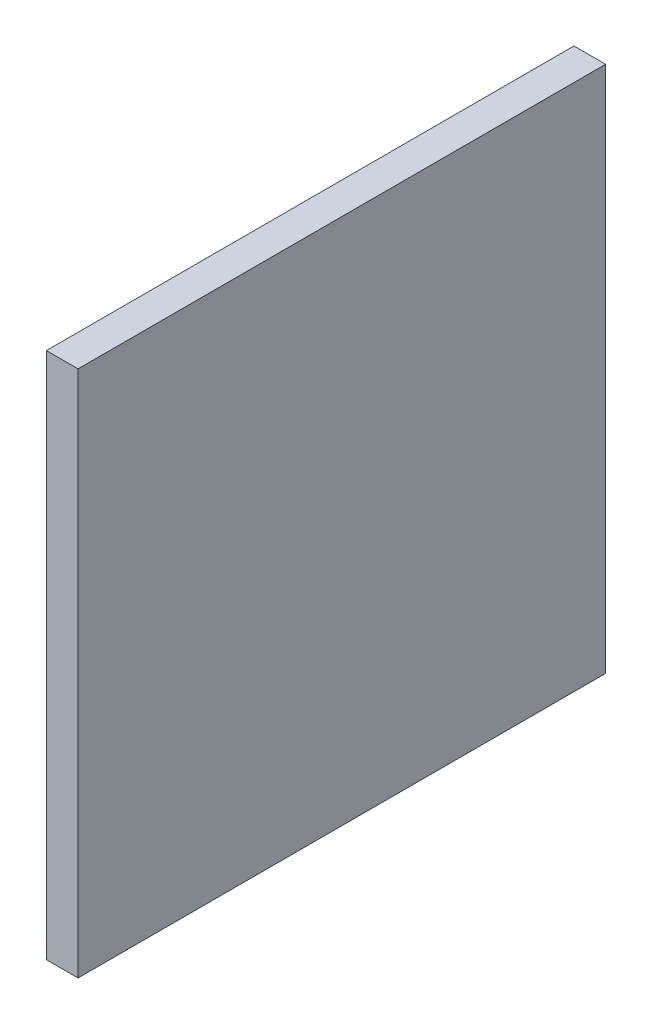
ISO-10303-21;
HEADER;
FILE_DESCRIPTION(('STEP AP214'),'2;1');
FILE_NAME('part.step','',(''),(''),'','','');
FILE_SCHEMA(('AUTOMOTIVE_DESIGN { 1 0 10303 214 1 1 1 1 }'));
ENDSEC;
DATA;
#1=APPLICATION_CONTEXT('core data for automotive mechanical design processes');
#2=APPLICATION_PROTOCOL_DEFINITION('international standard','automotive_design',2000,#1);
#3=PRODUCT_CONTEXT('',#1,'mechanical');
#4=PRODUCT('Part','Part','',(#3));
#5=PRODUCT_RELATED_PRODUCT_CATEGORY('part','',(#4));
#6=PRODUCT_DEFINITION_FORMATION('','',#4);
#7=PRODUCT_DEFINITION_CONTEXT('part definition',#1,'design');
#8=PRODUCT_DEFINITION('design','',#6,#7);
#9=PRODUCT_DEFINITION_SHAPE('','',#8);
#10=(LENGTH_UNIT() NAMED_UNIT(*) SI_UNIT(.MILLI.,.METRE.));
#11=(NAMED_UNIT(*) PLANE_ANGLE_UNIT() SI_UNIT($,.RADIAN.));
#12=(NAMED_UNIT(*) SI_UNIT($,.STERADIAN.) SOLID_ANGLE_UNIT());
#13=UNCERTAINTY_MEASURE_WITH_UNIT(LENGTH_MEASURE(1.E-05),#10,'distance_accuracy_value','');
#14=(GEOMETRIC_REPRESENTATION_CONTEXT(3) GLOBAL_UNCERTAINTY_ASSIGNED_CONTEXT((#13)) GLOBAL_UNIT_ASSIGNED_CONTEXT((#10,
#11,#12)) REPRESENTATION_CONTEXT('',''));
#15=CARTESIAN_POINT('',(0.,0.,0.));
#16=DIRECTION('',(0.,0.,1.));
#17=DIRECTION('',(1.,0.,0.));
#18=AXIS2_PLACEMENT_3D('',#15,#16,#17);
#19=CARTESIAN_POINT('',(3.,13.2737642124369,79.1817659079664));
#20=DIRECTION('',(0.,0.,-1.));
#21=DIRECTION('',(0.,1.,0.));
#22=AXIS2_PLACEMENT_3D('',#19,#20,#21);
#23=PLANE('',#22);
#24=DIRECTION('',(0.,-1.,0.));
#25=VECTOR('',#24,1.);
#26=CARTESIAN_POINT('',(0.,13.2737642124369,79.1817659079664));
#27=LINE('',#26,#25);
#28=CARTESIAN_POINT('',(0.,13.2737642124369,79.1817659079664));
#29=VERTEX_POINT('',#28);
#30=CARTESIAN_POINT('',(0.,-36.7262357875631,79.1817659079664));
#31=VERTEX_POINT('',#30);
#32=EDGE_CURVE('E96',#29,#31,#27,.T.);
#33=ORIENTED_EDGE('',*,*,#32,.T.);
#34=DIRECTION('',(-1.,0.,0.));
#35=VECTOR('',#34,1.);
#36=CARTESIAN_POINT('',(3.,-36.7262357875631,79.1817659079664));
#37=LINE('',#36,#35);
#38=CARTESIAN_POINT('',(3.,-36.7262357875631,79.1817659079664));
#39=VERTEX_POINT('',#38);
#40=EDGE_CURVE('E11',#39,#31,#37,.T.);
#41=ORIENTED_EDGE('',*,*,#40,.F.);
#42=DIRECTION('',(0.,-1.,0.));
#43=VECTOR('',#42,1.);
#44=CARTESIAN_POINT('',(3.,13.2737642124369,79.1817659079664));
#45=LINE('',#44,#43);
#46=CARTESIAN_POINT('',(3.,13.2737642124369,79.1817659079664));
#47=VERTEX_POINT('',#46);
#48=EDGE_CURVE('E84',#47,#39,#45,.T.);
#49=ORIENTED_EDGE('',*,*,#48,.F.);
#50=DIRECTION('',(-1.,0.,0.));
#51=VECTOR('',#50,1.);
#52=CARTESIAN_POINT('',(3.,13.2737642124369,79.1817659079664));
#53=LINE('',#52,#51);
#54=EDGE_CURVE('E92',#47,#29,#53,.T.);
#55=ORIENTED_EDGE('',*,*,#54,.T.);
#56=EDGE_LOOP('',(#33,#41,#49,#55));
#57=FACE_BOUND('',#56,.T.);
#58=ADVANCED_FACE('F33',(#57),#23,.F.);
#59=CARTESIAN_POINT('',(3.,-36.7262357875631,79.1817659079664));
#60=DIRECTION('',(0.,1.,0.));
#61=DIRECTION('',(0.,0.,1.));
#62=AXIS2_PLACEMENT_3D('',#59,#60,#61);
#63=PLANE('',#62);
#64=DIRECTION('',(0.,0.,-1.));
#65=VECTOR('',#64,1.);
#66=CARTESIAN_POINT('',(0.,-36.7262357875631,79.1817659079664));
#67=LINE('',#66,#65);
#68=CARTESIAN_POINT('',(0.,-36.7262357875631,29.1817659079664));
#69=VERTEX_POINT('',#68);
#70=EDGE_CURVE('E88',#31,#69,#67,.T.);
#71=ORIENTED_EDGE('',*,*,#70,.T.);
#72=DIRECTION('',(-1.,0.,0.));
#73=VECTOR('',#72,1.);
#74=CARTESIAN_POINT('',(3.,-36.7262357875631,29.1817659079664));
#75=LINE('',#74,#73);
#76=CARTESIAN_POINT('',(3.,-36.7262357875631,29.1817659079664));
#77=VERTEX_POINT('',#76);
#78=EDGE_CURVE('E41',#77,#69,#75,.T.);
#79=ORIENTED_EDGE('',*,*,#78,.F.);
#80=DIRECTION('',(0.,0.,-1.));
#81=VECTOR('',#80,1.);
#82=CARTESIAN_POINT('',(3.,-36.7262357875631,79.1817659079664));
#83=LINE('',#82,#81);
#84=EDGE_CURVE('E79',#39,#77,#83,.T.);
#85=ORIENTED_EDGE('',*,*,#84,.F.);
#86=ORIENTED_EDGE('',*,*,#40,.T.);
#87=EDGE_LOOP('',(#71,#79,#85,#86));
#88=FACE_BOUND('',#87,.T.);
#89=ADVANCED_FACE('F87',(#88),#63,.F.);
#90=CARTESIAN_POINT('',(3.,13.2737642124369,29.1817659079664));
#91=DIRECTION('',(0.,0.,1.));
#92=DIRECTION('',(0.,-1.,0.));
#93=AXIS2_PLACEMENT_3D('',#90,#91,#92);
#94=PLANE('',#93);
#95=DIRECTION('',(0.,1.,0.));
#96=VECTOR('',#95,1.);
#97=CARTESIAN_POINT('',(0.,13.2737642124369,29.1817659079664));
#98=LINE('',#97,#96);
#99=CARTESIAN_POINT('',(0.,13.2737642124369,29.1817659079664));
#100=VERTEX_POINT('',#99);
#101=EDGE_CURVE('E66',#69,#100,#98,.T.);
#102=ORIENTED_EDGE('',*,*,#101,.T.);
#103=DIRECTION('',(-1.,0.,0.));
#104=VECTOR('',#103,1.);
#105=CARTESIAN_POINT('',(3.,13.2737642124369,29.1817659079664));
#106=LINE('',#105,#104);
#107=CARTESIAN_POINT('',(3.,13.2737642124369,29.1817659079664));
#108=VERTEX_POINT('',#107);
#109=EDGE_CURVE('E89',#108,#100,#106,.T.);
#110=ORIENTED_EDGE('',*,*,#109,.F.);
#111=DIRECTION('',(0.,1.,0.));
#112=VECTOR('',#111,1.);
#113=CARTESIAN_POINT('',(3.,13.2737642124369,29.1817659079664));
#114=LINE('',#113,#112);
#115=EDGE_CURVE('E82',#77,#108,#114,.T.);
#116=ORIENTED_EDGE('',*,*,#115,.F.);
#117=ORIENTED_EDGE('',*,*,#78,.T.);
#118=EDGE_LOOP('',(#102,#110,#116,#117));
#119=FACE_BOUND('',#118,.T.);
#120=ADVANCED_FACE('F90',(#119),#94,.F.);
#121=CARTESIAN_POINT('',(3.,13.2737642124369,79.1817659079664));
#122=DIRECTION('',(0.,-1.,0.));
#123=DIRECTION('',(0.,0.,-1.));
#124=AXIS2_PLACEMENT_3D('',#121,#122,#123);
#125=PLANE('',#124);
#126=DIRECTION('',(0.,0.,1.));
#127=VECTOR('',#126,1.);
#128=CARTESIAN_POINT('',(0.,13.2737642124369,79.1817659079664));
#129=LINE('',#128,#127);
#130=EDGE_CURVE('E72',#100,#29,#129,.T.);
#131=ORIENTED_EDGE('',*,*,#130,.T.);
#132=ORIENTED_EDGE('',*,*,#54,.F.);
#133=DIRECTION('',(0.,0.,1.));
#134=VECTOR('',#133,1.);
#135=CARTESIAN_POINT('',(3.,13.2737642124369,79.1817659079664));
#136=LINE('',#135,#134);
#137=EDGE_CURVE('E49',#108,#47,#136,.T.);
#138=ORIENTED_EDGE('',*,*,#137,.F.);
#139=ORIENTED_EDGE('',*,*,#109,.T.);
#140=EDGE_LOOP('',(#131,#132,#138,#139));
#141=FACE_BOUND('',#140,.T.);
#142=ADVANCED_FACE('F103',(#141),#125,.F.);
#143=CARTESIAN_POINT('',(3.,0.,0.));
#144=DIRECTION('',(1.,0.,0.));
#145=DIRECTION('',(0.,0.,-1.));
#146=AXIS2_PLACEMENT_3D('',#143,#144,#145);
#147=PLANE('',#146);
#148=ORIENTED_EDGE('',*,*,#48,.T.);
#149=ORIENTED_EDGE('',*,*,#84,.T.);
#150=ORIENTED_EDGE('',*,*,#115,.T.);
#151=ORIENTED_EDGE('',*,*,#137,.T.);
#152=EDGE_LOOP('',(#148,#149,#150,#151));
#153=FACE_BOUND('',#152,.T.);
#154=ADVANCED_FACE('F80',(#153),#147,.T.);
#155=CARTESIAN_POINT('',(0.,0.,0.));
#156=DIRECTION('',(1.,0.,0.));
#157=DIRECTION('',(0.,0.,-1.));
#158=AXIS2_PLACEMENT_3D('',#155,#156,#157);
#159=PLANE('',#158);
#160=ORIENTED_EDGE('',*,*,#32,.F.);
#161=ORIENTED_EDGE('',*,*,#130,.F.);
#162=ORIENTED_EDGE('',*,*,#101,.F.);
#163=ORIENTED_EDGE('',*,*,#70,.F.);
#164=EDGE_LOOP('',(#160,#161,#162,#163));
#165=FACE_BOUND('',#164,.T.);
#166=ADVANCED_FACE('F106',(#165),#159,.F.);
#167=CLOSED_SHELL('',(#58,#89,#120,#142,#154,#166));
#168=MANIFOLD_SOLID_BREP('B2',#167);
#169=ADVANCED_BREP_SHAPE_REPRESENTATION('',(#18,#168),#14);
#170=SHAPE_DEFINITION_REPRESENTATION(#9,#169);
ENDSEC;
END-ISO-10303-21;
